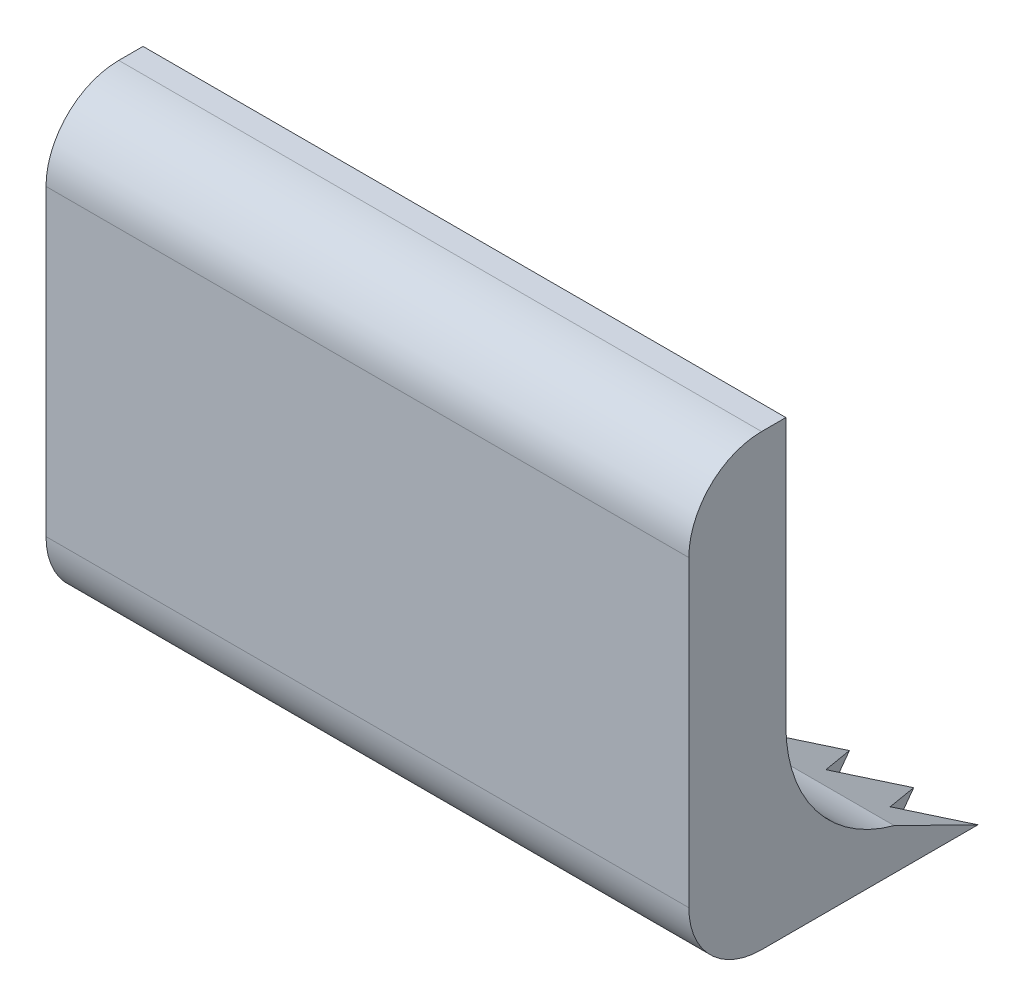
ISO-10303-21;
HEADER;
FILE_DESCRIPTION(('STEP AP214'),'2;1');
FILE_NAME('part.step','',(''),(''),'','','');
FILE_SCHEMA(('AUTOMOTIVE_DESIGN { 1 0 10303 214 1 1 1 1 }'));
ENDSEC;
DATA;
#1=APPLICATION_CONTEXT('core data for automotive mechanical design processes');
#2=APPLICATION_PROTOCOL_DEFINITION('international standard','automotive_design',2000,#1);
#3=PRODUCT_CONTEXT('',#1,'mechanical');
#4=PRODUCT('Part','Part','',(#3));
#5=PRODUCT_RELATED_PRODUCT_CATEGORY('part','',(#4));
#6=PRODUCT_DEFINITION_FORMATION('','',#4);
#7=PRODUCT_DEFINITION_CONTEXT('part definition',#1,'design');
#8=PRODUCT_DEFINITION('design','',#6,#7);
#9=PRODUCT_DEFINITION_SHAPE('','',#8);
#10=(LENGTH_UNIT() NAMED_UNIT(*) SI_UNIT(.MILLI.,.METRE.));
#11=(NAMED_UNIT(*) PLANE_ANGLE_UNIT() SI_UNIT($,.RADIAN.));
#12=(NAMED_UNIT(*) SI_UNIT($,.STERADIAN.) SOLID_ANGLE_UNIT());
#13=UNCERTAINTY_MEASURE_WITH_UNIT(LENGTH_MEASURE(1.E-05),#10,'distance_accuracy_value','');
#14=(GEOMETRIC_REPRESENTATION_CONTEXT(3) GLOBAL_UNCERTAINTY_ASSIGNED_CONTEXT((#13)) GLOBAL_UNIT_ASSIGNED_CONTEXT((#10,
#11,#12)) REPRESENTATION_CONTEXT('',''));
#15=CARTESIAN_POINT('',(0.,0.,0.));
#16=DIRECTION('',(0.,0.,1.));
#17=DIRECTION('',(1.,0.,0.));
#18=AXIS2_PLACEMENT_3D('',#15,#16,#17);
#19=CARTESIAN_POINT('',(26.5,-1.75000000000001,-4.));
#20=DIRECTION('',(-1.,0.,0.));
#21=DIRECTION('',(0.,0.,1.));
#22=AXIS2_PLACEMENT_3D('',#19,#20,#21);
#23=CYLINDRICAL_SURFACE('',#22,6.);
#24=CARTESIAN_POINT('',(26.5,-1.75000000000001,-4.));
#25=DIRECTION('',(-1.,0.,0.));
#26=DIRECTION('',(0.,0.,-1.));
#27=AXIS2_PLACEMENT_3D('',#24,#25,#26);
#28=CIRCLE('',#27,6.);
#29=CARTESIAN_POINT('',(26.5,-7.54940825383716,-2.46153846153846));
#30=VERTEX_POINT('',#29);
#31=CARTESIAN_POINT('',(26.5,-1.75000000000001,2.));
#32=VERTEX_POINT('',#31);
#33=EDGE_CURVE('E591',#30,#32,#28,.T.);
#34=ORIENTED_EDGE('',*,*,#33,.F.);
#35=DIRECTION('',(-1.,0.,0.));
#36=VECTOR('',#35,1.);
#37=CARTESIAN_POINT('',(26.5,-7.54940825383716,-2.46153846153846));
#38=LINE('',#37,#36);
#39=CARTESIAN_POINT('',(0.,-7.54940825383716,-2.46153846153846));
#40=VERTEX_POINT('',#39);
#41=EDGE_CURVE('E530',#30,#40,#38,.T.);
#42=ORIENTED_EDGE('',*,*,#41,.T.);
#43=CARTESIAN_POINT('',(0.,-1.75000000000001,-4.));
#44=DIRECTION('',(-1.,0.,0.));
#45=DIRECTION('',(0.,0.,-1.));
#46=AXIS2_PLACEMENT_3D('',#43,#44,#45);
#47=CIRCLE('',#46,6.);
#48=CARTESIAN_POINT('',(0.,-1.75000000000001,2.));
#49=VERTEX_POINT('',#48);
#50=EDGE_CURVE('E584',#40,#49,#47,.T.);
#51=ORIENTED_EDGE('',*,*,#50,.T.);
#52=DIRECTION('',(-1.,0.,0.));
#53=VECTOR('',#52,1.);
#54=CARTESIAN_POINT('',(26.5,-1.75000000000001,2.));
#55=LINE('',#54,#53);
#56=EDGE_CURVE('E634',#32,#49,#55,.T.);
#57=ORIENTED_EDGE('',*,*,#56,.F.);
#58=EDGE_LOOP('',(#34,#42,#51,#57));
#59=FACE_BOUND('',#58,.T.);
#60=ADVANCED_FACE('F359',(#59),#23,.F.);
#61=CARTESIAN_POINT('',(26.5,-1.75000000000001,2.));
#62=DIRECTION('',(0.,0.,1.));
#63=DIRECTION('',(0.,-1.,0.));
#64=AXIS2_PLACEMENT_3D('',#61,#62,#63);
#65=PLANE('',#64);
#66=DIRECTION('',(0.,1.,0.));
#67=VECTOR('',#66,1.);
#68=CARTESIAN_POINT('',(0.,-1.75000000000001,2.));
#69=LINE('',#68,#67);
#70=CARTESIAN_POINT('',(0.,9.25,2.));
#71=VERTEX_POINT('',#70);
#72=EDGE_CURVE('E608',#49,#71,#69,.T.);
#73=ORIENTED_EDGE('',*,*,#72,.T.);
#74=DIRECTION('',(-1.,0.,0.));
#75=VECTOR('',#74,1.);
#76=CARTESIAN_POINT('',(26.5,9.25,2.));
#77=LINE('',#76,#75);
#78=CARTESIAN_POINT('',(26.5,9.25,2.));
#79=VERTEX_POINT('',#78);
#80=EDGE_CURVE('E631',#79,#71,#77,.T.);
#81=ORIENTED_EDGE('',*,*,#80,.F.);
#82=DIRECTION('',(0.,1.,0.));
#83=VECTOR('',#82,1.);
#84=CARTESIAN_POINT('',(26.5,-1.75000000000001,2.));
#85=LINE('',#84,#83);
#86=EDGE_CURVE('E593',#32,#79,#85,.T.);
#87=ORIENTED_EDGE('',*,*,#86,.F.);
#88=ORIENTED_EDGE('',*,*,#56,.T.);
#89=EDGE_LOOP('',(#73,#81,#87,#88));
#90=FACE_BOUND('',#89,.T.);
#91=ADVANCED_FACE('F647',(#90),#65,.F.);
#92=CARTESIAN_POINT('',(26.5,9.25,2.));
#93=DIRECTION('',(0.,-1.,0.));
#94=DIRECTION('',(0.,0.,-1.));
#95=AXIS2_PLACEMENT_3D('',#92,#93,#94);
#96=PLANE('',#95);
#97=DIRECTION('',(0.,0.,1.));
#98=VECTOR('',#97,1.);
#99=CARTESIAN_POINT('',(0.,9.25,2.));
#100=LINE('',#99,#98);
#101=CARTESIAN_POINT('',(0.,9.25,3.));
#102=VERTEX_POINT('',#101);
#103=EDGE_CURVE('E610',#71,#102,#100,.T.);
#104=ORIENTED_EDGE('',*,*,#103,.T.);
#105=DIRECTION('',(-1.,0.,0.));
#106=VECTOR('',#105,1.);
#107=CARTESIAN_POINT('',(26.5,9.25,3.));
#108=LINE('',#107,#106);
#109=CARTESIAN_POINT('',(26.5,9.25,3.));
#110=VERTEX_POINT('',#109);
#111=EDGE_CURVE('E628',#110,#102,#108,.T.);
#112=ORIENTED_EDGE('',*,*,#111,.F.);
#113=DIRECTION('',(0.,0.,1.));
#114=VECTOR('',#113,1.);
#115=CARTESIAN_POINT('',(26.5,9.25,2.));
#116=LINE('',#115,#114);
#117=EDGE_CURVE('E596',#79,#110,#116,.T.);
#118=ORIENTED_EDGE('',*,*,#117,.F.);
#119=ORIENTED_EDGE('',*,*,#80,.T.);
#120=EDGE_LOOP('',(#104,#112,#118,#119));
#121=FACE_BOUND('',#120,.T.);
#122=ADVANCED_FACE('F651',(#121),#96,.F.);
#123=CARTESIAN_POINT('',(26.5,6.25,3.));
#124=DIRECTION('',(-1.,0.,0.));
#125=DIRECTION('',(0.,0.,1.));
#126=AXIS2_PLACEMENT_3D('',#123,#124,#125);
#127=CYLINDRICAL_SURFACE('',#126,3.);
#128=CARTESIAN_POINT('',(0.,6.25,3.));
#129=DIRECTION('',(1.,0.,0.));
#130=DIRECTION('',(0.,0.,1.));
#131=AXIS2_PLACEMENT_3D('',#128,#129,#130);
#132=CIRCLE('',#131,3.);
#133=CARTESIAN_POINT('',(0.,6.25,6.));
#134=VERTEX_POINT('',#133);
#135=EDGE_CURVE('E612',#102,#134,#132,.T.);
#136=ORIENTED_EDGE('',*,*,#135,.T.);
#137=DIRECTION('',(-1.,0.,0.));
#138=VECTOR('',#137,1.);
#139=CARTESIAN_POINT('',(26.5,6.25,6.));
#140=LINE('',#139,#138);
#141=CARTESIAN_POINT('',(26.5,6.25,6.));
#142=VERTEX_POINT('',#141);
#143=EDGE_CURVE('E625',#142,#134,#140,.T.);
#144=ORIENTED_EDGE('',*,*,#143,.F.);
#145=CARTESIAN_POINT('',(26.5,6.25,3.));
#146=DIRECTION('',(1.,0.,0.));
#147=DIRECTION('',(0.,0.,1.));
#148=AXIS2_PLACEMENT_3D('',#145,#146,#147);
#149=CIRCLE('',#148,3.);
#150=EDGE_CURVE('E598',#110,#142,#149,.T.);
#151=ORIENTED_EDGE('',*,*,#150,.F.);
#152=ORIENTED_EDGE('',*,*,#111,.T.);
#153=EDGE_LOOP('',(#136,#144,#151,#152));
#154=FACE_BOUND('',#153,.T.);
#155=ADVANCED_FACE('F659',(#154),#127,.T.);
#156=CARTESIAN_POINT('',(26.5,6.25,6.));
#157=DIRECTION('',(0.,0.,-1.));
#158=DIRECTION('',(-1.,0.,0.));
#159=AXIS2_PLACEMENT_3D('',#156,#157,#158);
#160=PLANE('',#159);
#161=DIRECTION('',(0.,-1.,0.));
#162=VECTOR('',#161,1.);
#163=CARTESIAN_POINT('',(0.,6.25,6.));
#164=LINE('',#163,#162);
#165=CARTESIAN_POINT('',(0.,-6.25,6.));
#166=VERTEX_POINT('',#165);
#167=EDGE_CURVE('E614',#134,#166,#164,.T.);
#168=ORIENTED_EDGE('',*,*,#167,.T.);
#169=DIRECTION('',(-1.,0.,0.));
#170=VECTOR('',#169,1.);
#171=CARTESIAN_POINT('',(26.5,-6.25,6.));
#172=LINE('',#171,#170);
#173=CARTESIAN_POINT('',(26.5,-6.25,6.));
#174=VERTEX_POINT('',#173);
#175=EDGE_CURVE('E622',#174,#166,#172,.T.);
#176=ORIENTED_EDGE('',*,*,#175,.F.);
#177=DIRECTION('',(0.,-1.,0.));
#178=VECTOR('',#177,1.);
#179=CARTESIAN_POINT('',(26.5,6.25,6.));
#180=LINE('',#179,#178);
#181=EDGE_CURVE('E600',#142,#174,#180,.T.);
#182=ORIENTED_EDGE('',*,*,#181,.F.);
#183=ORIENTED_EDGE('',*,*,#143,.T.);
#184=EDGE_LOOP('',(#168,#176,#182,#183));
#185=FACE_BOUND('',#184,.T.);
#186=ADVANCED_FACE('F662',(#185),#160,.F.);
#187=CARTESIAN_POINT('',(26.5,-6.25,3.));
#188=DIRECTION('',(-1.,0.,0.));
#189=DIRECTION('',(0.,0.,1.));
#190=AXIS2_PLACEMENT_3D('',#187,#188,#189);
#191=CYLINDRICAL_SURFACE('',#190,3.);
#192=CARTESIAN_POINT('',(0.,-6.25,3.));
#193=DIRECTION('',(1.,0.,0.));
#194=DIRECTION('',(0.,0.,1.));
#195=AXIS2_PLACEMENT_3D('',#192,#193,#194);
#196=CIRCLE('',#195,3.);
#197=CARTESIAN_POINT('',(0.,-9.25,3.));
#198=VERTEX_POINT('',#197);
#199=EDGE_CURVE('E616',#166,#198,#196,.T.);
#200=ORIENTED_EDGE('',*,*,#199,.T.);
#201=DIRECTION('',(-1.,0.,0.));
#202=VECTOR('',#201,1.);
#203=CARTESIAN_POINT('',(26.5,-9.25,3.));
#204=LINE('',#203,#202);
#205=CARTESIAN_POINT('',(26.5,-9.25,3.));
#206=VERTEX_POINT('',#205);
#207=EDGE_CURVE('E606',#206,#198,#204,.T.);
#208=ORIENTED_EDGE('',*,*,#207,.F.);
#209=CARTESIAN_POINT('',(26.5,-6.25,3.));
#210=DIRECTION('',(1.,0.,0.));
#211=DIRECTION('',(0.,0.,1.));
#212=AXIS2_PLACEMENT_3D('',#209,#210,#211);
#213=CIRCLE('',#212,3.);
#214=EDGE_CURVE('E602',#174,#206,#213,.T.);
#215=ORIENTED_EDGE('',*,*,#214,.F.);
#216=ORIENTED_EDGE('',*,*,#175,.T.);
#217=EDGE_LOOP('',(#200,#208,#215,#216));
#218=FACE_BOUND('',#217,.T.);
#219=ADVANCED_FACE('F667',(#218),#191,.T.);
#220=CARTESIAN_POINT('',(26.5,-9.25,3.));
#221=DIRECTION('',(0.,1.,0.));
#222=DIRECTION('',(0.,0.,1.));
#223=AXIS2_PLACEMENT_3D('',#220,#221,#222);
#224=PLANE('',#223);
#225=DIRECTION('',(0.5,0.,0.866025403784439));
#226=VECTOR('',#225,1.);
#227=CARTESIAN_POINT('',(28.3750652306178,-9.25,1.91743058435469));
#228=LINE('',#227,#226);
#229=CARTESIAN_POINT('',(23.85,-9.25,-5.92021230263876));
#230=VERTEX_POINT('',#229);
#231=CARTESIAN_POINT('',(25.175,-9.25,-3.62524498261));
#232=VERTEX_POINT('',#231);
#233=EDGE_CURVE('E515',#230,#232,#228,.T.);
#234=ORIENTED_EDGE('',*,*,#233,.T.);
#235=DIRECTION('',(0.5,0.,-0.866025403784439));
#236=VECTOR('',#235,1.);
#237=CARTESIAN_POINT('',(22.6374347693822,-9.25,0.769946924340312));
#238=LINE('',#237,#236);
#239=CARTESIAN_POINT('',(26.5,-9.25,-5.92021230263876));
#240=VERTEX_POINT('',#239);
#241=EDGE_CURVE('E524',#232,#240,#238,.T.);
#242=ORIENTED_EDGE('',*,*,#241,.T.);
#243=DIRECTION('',(0.,0.,-1.));
#244=VECTOR('',#243,1.);
#245=CARTESIAN_POINT('',(26.5,-9.25,3.));
#246=LINE('',#245,#244);
#247=EDGE_CURVE('E604',#206,#240,#246,.T.);
#248=ORIENTED_EDGE('',*,*,#247,.F.);
#249=ORIENTED_EDGE('',*,*,#207,.T.);
#250=DIRECTION('',(0.,0.,-1.));
#251=VECTOR('',#250,1.);
#252=CARTESIAN_POINT('',(0.,-9.25,3.));
#253=LINE('',#252,#251);
#254=CARTESIAN_POINT('',(0.,-9.25000000000008,-5.92021230263893));
#255=VERTEX_POINT('',#254);
#256=EDGE_CURVE('E594',#198,#255,#253,.T.);
#257=ORIENTED_EDGE('',*,*,#256,.T.);
#258=DIRECTION('',(0.5,0.,0.866025403784439));
#259=VECTOR('',#258,1.);
#260=CARTESIAN_POINT('',(10.4875652306179,-9.25,12.2447835244841));
#261=LINE('',#260,#259);
#262=CARTESIAN_POINT('',(1.325,-9.25,-3.62524498261016));
#263=VERTEX_POINT('',#262);
#264=EDGE_CURVE('E737',#255,#263,#261,.T.);
#265=ORIENTED_EDGE('',*,*,#264,.T.);
#266=DIRECTION('',(0.5,0.,-0.866025403784439));
#267=VECTOR('',#266,1.);
#268=CARTESIAN_POINT('',(4.7499347693821,-9.25,-9.55740601578916));
#269=LINE('',#268,#267);
#270=CARTESIAN_POINT('',(2.65,-9.25000000000002,-5.92021230263876));
#271=VERTEX_POINT('',#270);
#272=EDGE_CURVE('E723',#263,#271,#269,.T.);
#273=ORIENTED_EDGE('',*,*,#272,.T.);
#274=DIRECTION('',(0.5,0.,0.866025403784439));
#275=VECTOR('',#274,1.);
#276=CARTESIAN_POINT('',(12.4750652306179,-9.25,11.0972998644697));
#277=LINE('',#276,#275);
#278=CARTESIAN_POINT('',(3.975,-9.25,-3.62524498261015));
#279=VERTEX_POINT('',#278);
#280=EDGE_CURVE('E680',#271,#279,#277,.T.);
#281=ORIENTED_EDGE('',*,*,#280,.T.);
#282=DIRECTION('',(0.5,0.,-0.866025403784439));
#283=VECTOR('',#282,1.);
#284=CARTESIAN_POINT('',(6.73743476938211,-9.25,-8.40992235577478));
#285=LINE('',#284,#283);
#286=CARTESIAN_POINT('',(5.3,-9.25000000000002,-5.92021230263876));
#287=VERTEX_POINT('',#286);
#288=EDGE_CURVE('E675',#279,#287,#285,.T.);
#289=ORIENTED_EDGE('',*,*,#288,.T.);
#290=DIRECTION('',(0.5,0.,0.866025403784439));
#291=VECTOR('',#290,1.);
#292=CARTESIAN_POINT('',(14.4625652306179,-9.25,9.94981620445532));
#293=LINE('',#292,#291);
#294=CARTESIAN_POINT('',(6.625,-9.25,-3.62524498261013));
#295=VERTEX_POINT('',#294);
#296=EDGE_CURVE('E743',#287,#295,#293,.T.);
#297=ORIENTED_EDGE('',*,*,#296,.T.);
#298=DIRECTION('',(0.5,0.,-0.866025403784439));
#299=VECTOR('',#298,1.);
#300=CARTESIAN_POINT('',(8.72493476938211,-9.25,-7.26243869576039));
#301=LINE('',#300,#299);
#302=CARTESIAN_POINT('',(7.95,-9.25000000000001,-5.92021230263876));
#303=VERTEX_POINT('',#302);
#304=EDGE_CURVE('E740',#295,#303,#301,.T.);
#305=ORIENTED_EDGE('',*,*,#304,.T.);
#306=DIRECTION('',(0.5,0.,0.866025403784439));
#307=VECTOR('',#306,1.);
#308=CARTESIAN_POINT('',(16.4500652306179,-9.25,8.80233254444095));
#309=LINE('',#308,#307);
#310=CARTESIAN_POINT('',(9.275,-9.25,-3.62524498261011));
#311=VERTEX_POINT('',#310);
#312=EDGE_CURVE('E691',#303,#311,#309,.T.);
#313=ORIENTED_EDGE('',*,*,#312,.T.);
#314=DIRECTION('',(0.5,0.,-0.866025403784439));
#315=VECTOR('',#314,1.);
#316=CARTESIAN_POINT('',(10.7124347693821,-9.25,-6.11495503574601));
#317=LINE('',#316,#315);
#318=CARTESIAN_POINT('',(10.6,-9.25000000000001,-5.92021230263876));
#319=VERTEX_POINT('',#318);
#320=EDGE_CURVE('E686',#311,#319,#317,.T.);
#321=ORIENTED_EDGE('',*,*,#320,.T.);
#322=DIRECTION('',(0.5,0.,0.866025403784439));
#323=VECTOR('',#322,1.);
#324=CARTESIAN_POINT('',(18.4375652306179,-9.25,7.65484888442657));
#325=LINE('',#324,#323);
#326=CARTESIAN_POINT('',(11.925,-9.25,-3.62524498261009));
#327=VERTEX_POINT('',#326);
#328=EDGE_CURVE('E749',#319,#327,#325,.T.);
#329=ORIENTED_EDGE('',*,*,#328,.T.);
#330=DIRECTION('',(0.5,0.,-0.866025403784439));
#331=VECTOR('',#330,1.);
#332=CARTESIAN_POINT('',(12.6999347693821,-9.25,-4.96747137573162));
#333=LINE('',#332,#331);
#334=CARTESIAN_POINT('',(13.25,-9.25000000000001,-5.92021230263876));
#335=VERTEX_POINT('',#334);
#336=EDGE_CURVE('E746',#327,#335,#333,.T.);
#337=ORIENTED_EDGE('',*,*,#336,.T.);
#338=DIRECTION('',(0.5,0.,0.866025403784439));
#339=VECTOR('',#338,1.);
#340=CARTESIAN_POINT('',(20.4250652306179,-9.25,6.5073652244122));
#341=LINE('',#340,#339);
#342=CARTESIAN_POINT('',(14.575,-9.25,-3.62524498261007));
#343=VERTEX_POINT('',#342);
#344=EDGE_CURVE('E705',#335,#343,#341,.T.);
#345=ORIENTED_EDGE('',*,*,#344,.T.);
#346=DIRECTION('',(0.5,0.,-0.866025403784439));
#347=VECTOR('',#346,1.);
#348=CARTESIAN_POINT('',(14.6874347693821,-9.25,-3.81998771571723));
#349=LINE('',#348,#347);
#350=CARTESIAN_POINT('',(15.9,-9.25,-5.92021230263876));
#351=VERTEX_POINT('',#350);
#352=EDGE_CURVE('E699',#343,#351,#349,.T.);
#353=ORIENTED_EDGE('',*,*,#352,.T.);
#354=DIRECTION('',(0.5,0.,0.866025403784439));
#355=VECTOR('',#354,1.);
#356=CARTESIAN_POINT('',(22.4125652306178,-9.25,5.35988156439782));
#357=LINE('',#356,#355);
#358=CARTESIAN_POINT('',(17.225,-9.25,-3.62524498261005));
#359=VERTEX_POINT('',#358);
#360=EDGE_CURVE('E582',#351,#359,#357,.T.);
#361=ORIENTED_EDGE('',*,*,#360,.T.);
#362=DIRECTION('',(0.5,0.,-0.866025403784439));
#363=VECTOR('',#362,1.);
#364=CARTESIAN_POINT('',(16.6749347693822,-9.25,-2.67250405570285));
#365=LINE('',#364,#363);
#366=CARTESIAN_POINT('',(18.55,-9.25,-5.92021230263876));
#367=VERTEX_POINT('',#366);
#368=EDGE_CURVE('E587',#359,#367,#365,.T.);
#369=ORIENTED_EDGE('',*,*,#368,.T.);
#370=DIRECTION('',(0.5,0.,0.866025403784439));
#371=VECTOR('',#370,1.);
#372=CARTESIAN_POINT('',(24.4000652306178,-9.25,4.21239790438344));
#373=LINE('',#372,#371);
#374=CARTESIAN_POINT('',(19.875,-9.25,-3.62524498261003));
#375=VERTEX_POINT('',#374);
#376=EDGE_CURVE('E718',#367,#375,#373,.T.);
#377=ORIENTED_EDGE('',*,*,#376,.T.);
#378=DIRECTION('',(0.5,0.,-0.866025403784439));
#379=VECTOR('',#378,1.);
#380=CARTESIAN_POINT('',(18.6624347693822,-9.25,-1.52502039568846));
#381=LINE('',#380,#379);
#382=CARTESIAN_POINT('',(21.2,-9.25,-5.92021230263876));
#383=VERTEX_POINT('',#382);
#384=EDGE_CURVE('E713',#375,#383,#381,.T.);
#385=ORIENTED_EDGE('',*,*,#384,.T.);
#386=DIRECTION('',(0.5,0.,0.866025403784439));
#387=VECTOR('',#386,1.);
#388=CARTESIAN_POINT('',(26.3875652306178,-9.25,3.06491424436907));
#389=LINE('',#388,#387);
#390=CARTESIAN_POINT('',(22.525,-9.25,-3.62524498261002));
#391=VERTEX_POINT('',#390);
#392=EDGE_CURVE('E573',#383,#391,#389,.T.);
#393=ORIENTED_EDGE('',*,*,#392,.T.);
#394=DIRECTION('',(0.5,0.,-0.866025403784439));
#395=VECTOR('',#394,1.);
#396=CARTESIAN_POINT('',(20.6499347693822,-9.25,-0.377536735674077));
#397=LINE('',#396,#395);
#398=EDGE_CURVE('E578',#391,#230,#397,.T.);
#399=ORIENTED_EDGE('',*,*,#398,.T.);
#400=EDGE_LOOP('',(#234,#242,#248,#249,#257,#265,#273,#281,#289,#297,#305,#313,#321,#329,#337,
#345,#353,#361,#369,#377,#385,#393,#399));
#401=FACE_BOUND('',#400,.T.);
#402=ADVANCED_FACE('F580',(#401),#224,.F.);
#403=CARTESIAN_POINT('',(26.5,-1.75000000000001,-4.));
#404=DIRECTION('',(1.,0.,0.));
#405=DIRECTION('',(0.,0.,-1.));
#406=AXIS2_PLACEMENT_3D('',#403,#404,#405);
#407=PLANE('',#406);
#408=ORIENTED_EDGE('',*,*,#247,.T.);
#409=DIRECTION('',(0.,-0.441237046005556,-0.897390589003635));
#410=VECTOR('',#409,1.);
#411=CARTESIAN_POINT('',(26.5,-7.02949296806866,-1.40413158976388));
#412=LINE('',#411,#410);
#413=EDGE_CURVE('E528',#240,#30,#412,.F.);
#414=ORIENTED_EDGE('',*,*,#413,.T.);
#415=ORIENTED_EDGE('',*,*,#33,.T.);
#416=ORIENTED_EDGE('',*,*,#86,.T.);
#417=ORIENTED_EDGE('',*,*,#117,.T.);
#418=ORIENTED_EDGE('',*,*,#150,.T.);
#419=ORIENTED_EDGE('',*,*,#181,.T.);
#420=ORIENTED_EDGE('',*,*,#214,.T.);
#421=EDGE_LOOP('',(#408,#414,#415,#416,#417,#418,#419,#420));
#422=FACE_BOUND('',#421,.T.);
#423=ADVANCED_FACE('F654',(#422),#407,.T.);
#424=CARTESIAN_POINT('',(0.,-1.75000000000001,-4.));
#425=DIRECTION('',(1.,0.,0.));
#426=DIRECTION('',(0.,0.,-1.));
#427=AXIS2_PLACEMENT_3D('',#424,#425,#426);
#428=PLANE('',#427);
#429=ORIENTED_EDGE('',*,*,#50,.F.);
#430=DIRECTION('',(0.,0.441237046005556,0.897390589003635));
#431=VECTOR('',#430,1.);
#432=CARTESIAN_POINT('',(0.,-7.54940825383717,-2.46153846153846));
#433=LINE('',#432,#431);
#434=EDGE_CURVE('E535',#40,#255,#433,.F.);
#435=ORIENTED_EDGE('',*,*,#434,.T.);
#436=ORIENTED_EDGE('',*,*,#256,.F.);
#437=ORIENTED_EDGE('',*,*,#199,.F.);
#438=ORIENTED_EDGE('',*,*,#167,.F.);
#439=ORIENTED_EDGE('',*,*,#135,.F.);
#440=ORIENTED_EDGE('',*,*,#103,.F.);
#441=ORIENTED_EDGE('',*,*,#72,.F.);
#442=EDGE_LOOP('',(#429,#435,#436,#437,#438,#439,#440,#441));
#443=FACE_BOUND('',#442,.T.);
#444=ADVANCED_FACE('F641',(#443),#428,.F.);
#445=CARTESIAN_POINT('',(26.5,-7.54940825383717,-2.46153846153846));
#446=DIRECTION('',(0.,-0.897390589003635,0.441237046005556));
#447=DIRECTION('',(-1.,0.,0.));
#448=AXIS2_PLACEMENT_3D('',#445,#446,#447);
#449=PLANE('',#448);
#450=DIRECTION('',(-0.46003036300597,0.391775778284442,0.796795961750695));
#451=VECTOR('',#450,1.);
#452=CARTESIAN_POINT('',(24.9257264124449,-7.90930097316417,-3.1934904639796));
#453=LINE('',#452,#451);
#454=CARTESIAN_POINT('',(25.175,-8.1215899036861,-3.62524498261));
#455=VERTEX_POINT('',#454);
#456=EDGE_CURVE('E12',#455,#240,#453,.F.);
#457=ORIENTED_EDGE('',*,*,#456,.F.);
#458=DIRECTION('',(-0.46003036300597,-0.391775778284442,-0.796795961750695));
#459=VECTOR('',#458,1.);
#460=CARTESIAN_POINT('',(25.9850876150067,-7.43169477638616,-2.22213207483607));
#461=LINE('',#460,#459);
#462=EDGE_CURVE('E510',#230,#455,#461,.F.);
#463=ORIENTED_EDGE('',*,*,#462,.F.);
#464=DIRECTION('',(-0.46003036300597,0.391775778284442,0.796795961750695));
#465=VECTOR('',#464,1.);
#466=CARTESIAN_POINT('',(22.8365404398965,-8.38690716994219,-4.16484885312315));
#467=LINE('',#466,#465);
#468=CARTESIAN_POINT('',(22.525,-8.12158990368611,-3.62524498261001));
#469=VERTEX_POINT('',#468);
#470=EDGE_CURVE('E564',#469,#230,#467,.F.);
#471=ORIENTED_EDGE('',*,*,#470,.F.);
#472=DIRECTION('',(-0.46003036300597,-0.391775778284442,-0.796795961750695));
#473=VECTOR('',#472,1.);
#474=CARTESIAN_POINT('',(23.8959016424583,-6.95408857960814,-1.25077368569253));
#475=LINE('',#474,#473);
#476=EDGE_CURVE('E367',#383,#469,#475,.F.);
#477=ORIENTED_EDGE('',*,*,#476,.F.);
#478=DIRECTION('',(-0.46003036300597,0.391775778284442,0.796795961750695));
#479=VECTOR('',#478,1.);
#480=CARTESIAN_POINT('',(20.7473544673481,-8.86451336672021,-5.13620724226669));
#481=LINE('',#480,#479);
#482=CARTESIAN_POINT('',(19.875,-8.12158990368612,-3.62524498261003));
#483=VERTEX_POINT('',#482);
#484=EDGE_CURVE('E711',#483,#383,#481,.F.);
#485=ORIENTED_EDGE('',*,*,#484,.F.);
#486=DIRECTION('',(-0.46003036300597,-0.391775778284442,-0.796795961750695));
#487=VECTOR('',#486,1.);
#488=CARTESIAN_POINT('',(21.80671566991,-6.47648238283013,-0.279415296549001));
#489=LINE('',#488,#487);
#490=EDGE_CURVE('E715',#367,#483,#489,.F.);
#491=ORIENTED_EDGE('',*,*,#490,.F.);
#492=DIRECTION('',(-0.46003036300597,0.391775778284442,0.796795961750695));
#493=VECTOR('',#492,1.);
#494=CARTESIAN_POINT('',(18.6581684947997,-9.34211956349823,-6.10756563141023));
#495=LINE('',#494,#493);
#496=CARTESIAN_POINT('',(17.225,-8.12158990368613,-3.62524498261005));
#497=VERTEX_POINT('',#496);
#498=EDGE_CURVE('E558',#497,#367,#495,.F.);
#499=ORIENTED_EDGE('',*,*,#498,.F.);
#500=DIRECTION('',(-0.46003036300597,-0.391775778284442,-0.796795961750695));
#501=VECTOR('',#500,1.);
#502=CARTESIAN_POINT('',(19.7175296973616,-5.99887618605211,0.691943092594536));
#503=LINE('',#502,#501);
#504=EDGE_CURVE('E561',#351,#497,#503,.F.);
#505=ORIENTED_EDGE('',*,*,#504,.F.);
#506=DIRECTION('',(-0.46003036300597,0.391775778284442,0.796795961750695));
#507=VECTOR('',#506,1.);
#508=CARTESIAN_POINT('',(16.5689825222514,-9.81972576027624,-7.07892402055377));
#509=LINE('',#508,#507);
#510=CARTESIAN_POINT('',(14.575,-8.12158990368613,-3.62524498261007));
#511=VERTEX_POINT('',#510);
#512=EDGE_CURVE('E697',#511,#351,#509,.F.);
#513=ORIENTED_EDGE('',*,*,#512,.F.);
#514=DIRECTION('',(-0.46003036300597,-0.391775778284442,-0.796795961750695));
#515=VECTOR('',#514,1.);
#516=CARTESIAN_POINT('',(17.6283437248132,-5.5212699892741,1.66330148173807));
#517=LINE('',#516,#515);
#518=EDGE_CURVE('E702',#335,#511,#517,.F.);
#519=ORIENTED_EDGE('',*,*,#518,.F.);
#520=DIRECTION('',(-0.46003036300597,0.391775778284442,0.796795961750695));
#521=VECTOR('',#520,1.);
#522=CARTESIAN_POINT('',(14.479796549703,-10.2973319570543,-8.05028240969732));
#523=LINE('',#522,#521);
#524=CARTESIAN_POINT('',(11.925,-8.12158990368614,-3.62524498261009));
#525=VERTEX_POINT('',#524);
#526=EDGE_CURVE('E552',#525,#335,#523,.F.);
#527=ORIENTED_EDGE('',*,*,#526,.F.);
#528=DIRECTION('',(-0.46003036300597,-0.391775778284442,-0.796795961750695));
#529=VECTOR('',#528,1.);
#530=CARTESIAN_POINT('',(15.5391577522649,-5.04366379249608,2.6346598708816));
#531=LINE('',#530,#529);
#532=EDGE_CURVE('E555',#319,#525,#531,.F.);
#533=ORIENTED_EDGE('',*,*,#532,.F.);
#534=DIRECTION('',(-0.46003036300597,0.391775778284442,0.796795961750695));
#535=VECTOR('',#534,1.);
#536=CARTESIAN_POINT('',(12.3906105771546,-10.7749381538323,-9.02164079884086));
#537=LINE('',#536,#535);
#538=CARTESIAN_POINT('',(9.275,-8.12158990368615,-3.6252449826101));
#539=VERTEX_POINT('',#538);
#540=EDGE_CURVE('E684',#539,#319,#537,.F.);
#541=ORIENTED_EDGE('',*,*,#540,.F.);
#542=DIRECTION('',(-0.46003036300597,-0.391775778284442,-0.796795961750695));
#543=VECTOR('',#542,1.);
#544=CARTESIAN_POINT('',(13.4499717797165,-4.56605759571807,3.60601826002514));
#545=LINE('',#544,#543);
#546=EDGE_CURVE('E689',#303,#539,#545,.F.);
#547=ORIENTED_EDGE('',*,*,#546,.F.);
#548=DIRECTION('',(-0.46003036300597,0.391775778284442,0.796795961750695));
#549=VECTOR('',#548,1.);
#550=CARTESIAN_POINT('',(10.3014246046062,-11.2525443506103,-9.9929991879844));
#551=LINE('',#550,#549);
#552=CARTESIAN_POINT('',(6.62499999999999,-8.12158990368616,-3.62524498261012));
#553=VERTEX_POINT('',#552);
#554=EDGE_CURVE('E546',#553,#303,#551,.F.);
#555=ORIENTED_EDGE('',*,*,#554,.F.);
#556=DIRECTION('',(-0.46003036300597,-0.391775778284442,-0.796795961750695));
#557=VECTOR('',#556,1.);
#558=CARTESIAN_POINT('',(11.3607858071681,-4.08845139894005,4.57737664916867));
#559=LINE('',#558,#557);
#560=EDGE_CURVE('E549',#287,#553,#559,.F.);
#561=ORIENTED_EDGE('',*,*,#560,.F.);
#562=DIRECTION('',(-0.46003036300597,0.391775778284442,0.796795961750695));
#563=VECTOR('',#562,1.);
#564=CARTESIAN_POINT('',(8.21223863205782,-11.7301505473883,-10.9643575771279));
#565=LINE('',#564,#563);
#566=CARTESIAN_POINT('',(3.975,-8.12158990368617,-3.62524498261014));
#567=VERTEX_POINT('',#566);
#568=EDGE_CURVE('E670',#567,#287,#565,.F.);
#569=ORIENTED_EDGE('',*,*,#568,.F.);
#570=DIRECTION('',(-0.46003036300597,-0.391775778284442,-0.796795961750695));
#571=VECTOR('',#570,1.);
#572=CARTESIAN_POINT('',(9.27159983461976,-3.61084520216204,5.54873503831221));
#573=LINE('',#572,#571);
#574=EDGE_CURVE('E678',#271,#567,#573,.F.);
#575=ORIENTED_EDGE('',*,*,#574,.F.);
#576=DIRECTION('',(-0.46003036300597,0.391775778284442,0.796795961750695));
#577=VECTOR('',#576,1.);
#578=CARTESIAN_POINT('',(6.12305265950944,-12.2077567441663,-11.9357159662715));
#579=LINE('',#578,#577);
#580=CARTESIAN_POINT('',(1.325,-8.12158990368618,-3.62524498261016));
#581=VERTEX_POINT('',#580);
#582=EDGE_CURVE('E534',#581,#271,#579,.F.);
#583=ORIENTED_EDGE('',*,*,#582,.F.);
#584=DIRECTION('',(-0.46003036300597,-0.391775778284442,-0.796795961750695));
#585=VECTOR('',#584,1.);
#586=CARTESIAN_POINT('',(7.1824138620714,-3.13323900538402,6.52009342745574));
#587=LINE('',#586,#585);
#588=EDGE_CURVE('E538',#255,#581,#587,.F.);
#589=ORIENTED_EDGE('',*,*,#588,.F.);
#590=ORIENTED_EDGE('',*,*,#434,.F.);
#591=ORIENTED_EDGE('',*,*,#41,.F.);
#592=ORIENTED_EDGE('',*,*,#413,.F.);
#593=EDGE_LOOP('',(#457,#463,#471,#477,#485,#491,#499,#505,#513,#519,#527,#533,#541,#547,#555,
#561,#569,#575,#583,#589,#590,#591,#592));
#594=FACE_BOUND('',#593,.T.);
#595=ADVANCED_FACE('F361',(#594),#449,.F.);
#596=CARTESIAN_POINT('',(1.325,9.25000000000001,-3.62524498261016));
#597=DIRECTION('',(-0.866025403784439,0.,0.5));
#598=DIRECTION('',(0.5,0.,0.866025403784439));
#599=AXIS2_PLACEMENT_3D('',#596,#597,#598);
#600=PLANE('',#599);
#601=ORIENTED_EDGE('',*,*,#588,.T.);
#602=DIRECTION('',(0.,-1.,0.));
#603=VECTOR('',#602,1.);
#604=CARTESIAN_POINT('',(1.325,9.25000000000001,-3.62524498261016));
#605=LINE('',#604,#603);
#606=EDGE_CURVE('E721',#581,#263,#605,.T.);
#607=ORIENTED_EDGE('',*,*,#606,.T.);
#608=ORIENTED_EDGE('',*,*,#264,.F.);
#609=EDGE_LOOP('',(#601,#607,#608));
#610=FACE_BOUND('',#609,.T.);
#611=ADVANCED_FACE('F800',(#610),#600,.F.);
#612=CARTESIAN_POINT('',(2.65,9.25000000000001,-5.92021230263892));
#613=DIRECTION('',(0.866025403784439,0.,0.5));
#614=DIRECTION('',(0.5,0.,-0.866025403784439));
#615=AXIS2_PLACEMENT_3D('',#612,#613,#614);
#616=PLANE('',#615);
#617=ORIENTED_EDGE('',*,*,#606,.F.);
#618=ORIENTED_EDGE('',*,*,#582,.T.);
#619=ORIENTED_EDGE('',*,*,#272,.F.);
#620=EDGE_LOOP('',(#617,#618,#619));
#621=FACE_BOUND('',#620,.T.);
#622=ADVANCED_FACE('F796',(#621),#616,.F.);
#623=CARTESIAN_POINT('',(6.53852712494122,9.25000000000001,-3.77502039568848));
#624=DIRECTION('',(-0.866025403784439,0.,0.5));
#625=DIRECTION('',(0.5,0.,0.866025403784439));
#626=AXIS2_PLACEMENT_3D('',#623,#624,#625);
#627=PLANE('',#626);
#628=ORIENTED_EDGE('',*,*,#560,.T.);
#629=DIRECTION('',(0.,-1.,0.));
#630=VECTOR('',#629,1.);
#631=CARTESIAN_POINT('',(6.625,9.25000000000001,-3.62524498261012));
#632=LINE('',#631,#630);
#633=EDGE_CURVE('E730',#553,#295,#632,.T.);
#634=ORIENTED_EDGE('',*,*,#633,.T.);
#635=ORIENTED_EDGE('',*,*,#296,.F.);
#636=EDGE_LOOP('',(#628,#634,#635));
#637=FACE_BOUND('',#636,.T.);
#638=ADVANCED_FACE('F799',(#637),#627,.F.);
#639=CARTESIAN_POINT('',(3.39897287505878,9.25000000000001,1.96239790438342));
#640=DIRECTION('',(0.866025403784439,0.,0.5));
#641=DIRECTION('',(0.5,0.,-0.866025403784439));
#642=AXIS2_PLACEMENT_3D('',#639,#640,#641);
#643=PLANE('',#642);
#644=ORIENTED_EDGE('',*,*,#633,.F.);
#645=ORIENTED_EDGE('',*,*,#554,.T.);
#646=ORIENTED_EDGE('',*,*,#304,.F.);
#647=EDGE_LOOP('',(#644,#645,#646));
#648=FACE_BOUND('',#647,.T.);
#649=ADVANCED_FACE('F807',(#648),#643,.F.);
#650=CARTESIAN_POINT('',(10.5135271249412,9.25000000000001,-6.06998771571723));
#651=DIRECTION('',(-0.866025403784439,0.,0.5));
#652=DIRECTION('',(0.5,0.,0.866025403784439));
#653=AXIS2_PLACEMENT_3D('',#650,#651,#652);
#654=PLANE('',#653);
#655=ORIENTED_EDGE('',*,*,#532,.T.);
#656=DIRECTION('',(0.,-1.,0.));
#657=VECTOR('',#656,1.);
#658=CARTESIAN_POINT('',(11.925,9.25000000000001,-3.62524498261009));
#659=LINE('',#658,#657);
#660=EDGE_CURVE('E727',#525,#327,#659,.T.);
#661=ORIENTED_EDGE('',*,*,#660,.T.);
#662=ORIENTED_EDGE('',*,*,#328,.F.);
#663=EDGE_LOOP('',(#655,#661,#662));
#664=FACE_BOUND('',#663,.T.);
#665=ADVANCED_FACE('F811',(#664),#654,.F.);
#666=CARTESIAN_POINT('',(7.3739728750588,9.25000000000001,4.25736522441219));
#667=DIRECTION('',(0.866025403784439,0.,0.5));
#668=DIRECTION('',(0.5,0.,-0.866025403784439));
#669=AXIS2_PLACEMENT_3D('',#666,#667,#668);
#670=PLANE('',#669);
#671=ORIENTED_EDGE('',*,*,#660,.F.);
#672=ORIENTED_EDGE('',*,*,#526,.T.);
#673=ORIENTED_EDGE('',*,*,#336,.F.);
#674=EDGE_LOOP('',(#671,#672,#673));
#675=FACE_BOUND('',#674,.T.);
#676=ADVANCED_FACE('F815',(#675),#670,.F.);
#677=CARTESIAN_POINT('',(14.4885271249412,9.25000000000001,-8.36495503574599));
#678=DIRECTION('',(-0.866025403784439,0.,0.5));
#679=DIRECTION('',(0.5,0.,0.866025403784439));
#680=AXIS2_PLACEMENT_3D('',#677,#678,#679);
#681=PLANE('',#680);
#682=ORIENTED_EDGE('',*,*,#504,.T.);
#683=DIRECTION('',(0.,-1.,0.));
#684=VECTOR('',#683,1.);
#685=CARTESIAN_POINT('',(17.225,9.25000000000001,-3.62524498261005));
#686=LINE('',#685,#684);
#687=EDGE_CURVE('E724',#497,#359,#686,.T.);
#688=ORIENTED_EDGE('',*,*,#687,.T.);
#689=ORIENTED_EDGE('',*,*,#360,.F.);
#690=EDGE_LOOP('',(#682,#688,#689));
#691=FACE_BOUND('',#690,.T.);
#692=ADVANCED_FACE('F757',(#691),#681,.F.);
#693=CARTESIAN_POINT('',(11.3489728750588,9.25,6.55233254444097));
#694=DIRECTION('',(0.866025403784439,0.,0.5));
#695=DIRECTION('',(0.5,0.,-0.866025403784439));
#696=AXIS2_PLACEMENT_3D('',#693,#694,#695);
#697=PLANE('',#696);
#698=ORIENTED_EDGE('',*,*,#687,.F.);
#699=ORIENTED_EDGE('',*,*,#498,.T.);
#700=ORIENTED_EDGE('',*,*,#368,.F.);
#701=EDGE_LOOP('',(#698,#699,#700));
#702=FACE_BOUND('',#701,.T.);
#703=ADVANCED_FACE('F754',(#702),#697,.F.);
#704=CARTESIAN_POINT('',(18.4635271249412,9.25000000000001,-10.6599223557747));
#705=DIRECTION('',(-0.866025403784439,0.,0.5));
#706=DIRECTION('',(0.5,0.,0.866025403784439));
#707=AXIS2_PLACEMENT_3D('',#704,#705,#706);
#708=PLANE('',#707);
#709=ORIENTED_EDGE('',*,*,#476,.T.);
#710=DIRECTION('',(0.,-1.,0.));
#711=VECTOR('',#710,1.);
#712=CARTESIAN_POINT('',(22.525,9.25000000000001,-3.62524498261001));
#713=LINE('',#712,#711);
#714=EDGE_CURVE('E571',#469,#391,#713,.T.);
#715=ORIENTED_EDGE('',*,*,#714,.T.);
#716=ORIENTED_EDGE('',*,*,#392,.F.);
#717=EDGE_LOOP('',(#709,#715,#716));
#718=FACE_BOUND('',#717,.T.);
#719=ADVANCED_FACE('F570',(#718),#708,.F.);
#720=CARTESIAN_POINT('',(15.3239728750588,9.25,8.84729986446974));
#721=DIRECTION('',(0.866025403784439,0.,0.5));
#722=DIRECTION('',(0.5,0.,-0.866025403784439));
#723=AXIS2_PLACEMENT_3D('',#720,#721,#722);
#724=PLANE('',#723);
#725=ORIENTED_EDGE('',*,*,#714,.F.);
#726=ORIENTED_EDGE('',*,*,#470,.T.);
#727=ORIENTED_EDGE('',*,*,#398,.F.);
#728=EDGE_LOOP('',(#725,#726,#727));
#729=FACE_BOUND('',#728,.T.);
#730=ADVANCED_FACE('F577',(#729),#724,.F.);
#731=CARTESIAN_POINT('',(16.4760271249412,9.25000000000001,-9.51243869576036));
#732=DIRECTION('',(-0.866025403784439,0.,0.5));
#733=DIRECTION('',(0.5,0.,0.866025403784439));
#734=AXIS2_PLACEMENT_3D('',#731,#732,#733);
#735=PLANE('',#734);
#736=ORIENTED_EDGE('',*,*,#490,.T.);
#737=DIRECTION('',(0.,-1.,0.));
#738=VECTOR('',#737,1.);
#739=CARTESIAN_POINT('',(19.875,9.25000000000001,-3.62524498261003));
#740=LINE('',#739,#738);
#741=EDGE_CURVE('E708',#483,#375,#740,.T.);
#742=ORIENTED_EDGE('',*,*,#741,.T.);
#743=ORIENTED_EDGE('',*,*,#376,.F.);
#744=EDGE_LOOP('',(#736,#742,#743));
#745=FACE_BOUND('',#744,.T.);
#746=ADVANCED_FACE('F762',(#745),#735,.F.);
#747=CARTESIAN_POINT('',(13.3364728750588,9.25,7.69981620445535));
#748=DIRECTION('',(0.866025403784439,0.,0.5));
#749=DIRECTION('',(0.5,0.,-0.866025403784439));
#750=AXIS2_PLACEMENT_3D('',#747,#748,#749);
#751=PLANE('',#750);
#752=ORIENTED_EDGE('',*,*,#741,.F.);
#753=ORIENTED_EDGE('',*,*,#484,.T.);
#754=ORIENTED_EDGE('',*,*,#384,.F.);
#755=EDGE_LOOP('',(#752,#753,#754));
#756=FACE_BOUND('',#755,.T.);
#757=ADVANCED_FACE('F764',(#756),#751,.F.);
#758=CARTESIAN_POINT('',(12.5010271249412,9.25000000000001,-7.21747137573161));
#759=DIRECTION('',(-0.866025403784439,0.,0.5));
#760=DIRECTION('',(0.5,0.,0.866025403784439));
#761=AXIS2_PLACEMENT_3D('',#758,#759,#760);
#762=PLANE('',#761);
#763=ORIENTED_EDGE('',*,*,#518,.T.);
#764=DIRECTION('',(0.,-1.,0.));
#765=VECTOR('',#764,1.);
#766=CARTESIAN_POINT('',(14.575,9.25000000000001,-3.62524498261007));
#767=LINE('',#766,#765);
#768=EDGE_CURVE('E694',#511,#343,#767,.T.);
#769=ORIENTED_EDGE('',*,*,#768,.T.);
#770=ORIENTED_EDGE('',*,*,#344,.F.);
#771=EDGE_LOOP('',(#763,#769,#770));
#772=FACE_BOUND('',#771,.T.);
#773=ADVANCED_FACE('F766',(#772),#762,.F.);
#774=CARTESIAN_POINT('',(9.36147287505881,9.25000000000001,5.40484888442658));
#775=DIRECTION('',(0.866025403784439,0.,0.5));
#776=DIRECTION('',(0.5,0.,-0.866025403784439));
#777=AXIS2_PLACEMENT_3D('',#774,#775,#776);
#778=PLANE('',#777);
#779=ORIENTED_EDGE('',*,*,#768,.F.);
#780=ORIENTED_EDGE('',*,*,#512,.T.);
#781=ORIENTED_EDGE('',*,*,#352,.F.);
#782=EDGE_LOOP('',(#779,#780,#781));
#783=FACE_BOUND('',#782,.T.);
#784=ADVANCED_FACE('F772',(#783),#778,.F.);
#785=CARTESIAN_POINT('',(8.52602712494121,9.25000000000001,-4.92250405570286));
#786=DIRECTION('',(-0.866025403784439,0.,0.5));
#787=DIRECTION('',(0.5,0.,0.866025403784439));
#788=AXIS2_PLACEMENT_3D('',#785,#786,#787);
#789=PLANE('',#788);
#790=ORIENTED_EDGE('',*,*,#546,.T.);
#791=DIRECTION('',(0.,-1.,0.));
#792=VECTOR('',#791,1.);
#793=CARTESIAN_POINT('',(9.275,9.25000000000001,-3.6252449826101));
#794=LINE('',#793,#792);
#795=EDGE_CURVE('E382',#539,#311,#794,.T.);
#796=ORIENTED_EDGE('',*,*,#795,.T.);
#797=ORIENTED_EDGE('',*,*,#312,.F.);
#798=EDGE_LOOP('',(#790,#796,#797));
#799=FACE_BOUND('',#798,.T.);
#800=ADVANCED_FACE('F858',(#799),#789,.F.);
#801=CARTESIAN_POINT('',(5.38647287505879,9.25000000000001,3.10988156439781));
#802=DIRECTION('',(0.866025403784439,0.,0.5));
#803=DIRECTION('',(0.5,0.,-0.866025403784439));
#804=AXIS2_PLACEMENT_3D('',#801,#802,#803);
#805=PLANE('',#804);
#806=ORIENTED_EDGE('',*,*,#795,.F.);
#807=ORIENTED_EDGE('',*,*,#540,.T.);
#808=ORIENTED_EDGE('',*,*,#320,.F.);
#809=EDGE_LOOP('',(#806,#807,#808));
#810=FACE_BOUND('',#809,.T.);
#811=ADVANCED_FACE('F868',(#810),#805,.F.);
#812=CARTESIAN_POINT('',(4.55102712494123,9.25000000000001,-2.6275367356741));
#813=DIRECTION('',(-0.866025403784439,0.,0.5));
#814=DIRECTION('',(0.5,0.,0.866025403784439));
#815=AXIS2_PLACEMENT_3D('',#812,#813,#814);
#816=PLANE('',#815);
#817=ORIENTED_EDGE('',*,*,#574,.T.);
#818=DIRECTION('',(0.,-1.,0.));
#819=VECTOR('',#818,1.);
#820=CARTESIAN_POINT('',(3.975,9.25000000000001,-3.62524498261014));
#821=LINE('',#820,#819);
#822=EDGE_CURVE('E374',#567,#279,#821,.T.);
#823=ORIENTED_EDGE('',*,*,#822,.T.);
#824=ORIENTED_EDGE('',*,*,#280,.F.);
#825=EDGE_LOOP('',(#817,#823,#824));
#826=FACE_BOUND('',#825,.T.);
#827=ADVANCED_FACE('F878',(#826),#816,.F.);
#828=CARTESIAN_POINT('',(1.41147287505877,9.25000000000001,0.814914244369038));
#829=DIRECTION('',(0.866025403784439,0.,0.5));
#830=DIRECTION('',(0.5,0.,-0.866025403784439));
#831=AXIS2_PLACEMENT_3D('',#828,#829,#830);
#832=PLANE('',#831);
#833=ORIENTED_EDGE('',*,*,#822,.F.);
#834=ORIENTED_EDGE('',*,*,#568,.T.);
#835=ORIENTED_EDGE('',*,*,#288,.F.);
#836=EDGE_LOOP('',(#833,#834,#835));
#837=FACE_BOUND('',#836,.T.);
#838=ADVANCED_FACE('F887',(#837),#832,.F.);
#839=CARTESIAN_POINT('',(17.3114728750588,9.25,9.99478352448413));
#840=DIRECTION('',(0.866025403784439,0.,0.5));
#841=DIRECTION('',(0.5,0.,-0.866025403784439));
#842=AXIS2_PLACEMENT_3D('',#839,#840,#841);
#843=PLANE('',#842);
#844=DIRECTION('',(0.,-1.,0.));
#845=VECTOR('',#844,1.);
#846=CARTESIAN_POINT('',(25.175,9.25000000000001,-3.62524498260999));
#847=LINE('',#846,#845);
#848=EDGE_CURVE('E513',#455,#232,#847,.T.);
#849=ORIENTED_EDGE('',*,*,#848,.F.);
#850=ORIENTED_EDGE('',*,*,#456,.T.);
#851=ORIENTED_EDGE('',*,*,#241,.F.);
#852=EDGE_LOOP('',(#849,#850,#851));
#853=FACE_BOUND('',#852,.T.);
#854=ADVANCED_FACE('F522',(#853),#843,.F.);
#855=CARTESIAN_POINT('',(20.4510271249412,9.25000000000001,-11.8074060157891));
#856=DIRECTION('',(-0.866025403784439,0.,0.5));
#857=DIRECTION('',(0.5,0.,0.866025403784439));
#858=AXIS2_PLACEMENT_3D('',#855,#856,#857);
#859=PLANE('',#858);
#860=ORIENTED_EDGE('',*,*,#462,.T.);
#861=ORIENTED_EDGE('',*,*,#848,.T.);
#862=ORIENTED_EDGE('',*,*,#233,.F.);
#863=EDGE_LOOP('',(#860,#861,#862));
#864=FACE_BOUND('',#863,.T.);
#865=ADVANCED_FACE('F512',(#864),#859,.F.);
#866=CLOSED_SHELL('',(#60,#91,#122,#155,#186,#219,#402,#423,#444,#595,#611,#622,#638,#649,#665,
#676,#692,#703,#719,#730,#746,#757,#773,#784,#800,#811,#827,#838,#854,#865));
#867=MANIFOLD_SOLID_BREP('B2',#866);
#868=ADVANCED_BREP_SHAPE_REPRESENTATION('',(#18,#867),#14);
#869=SHAPE_DEFINITION_REPRESENTATION(#9,#868);
ENDSEC;
END-ISO-10303-21;
